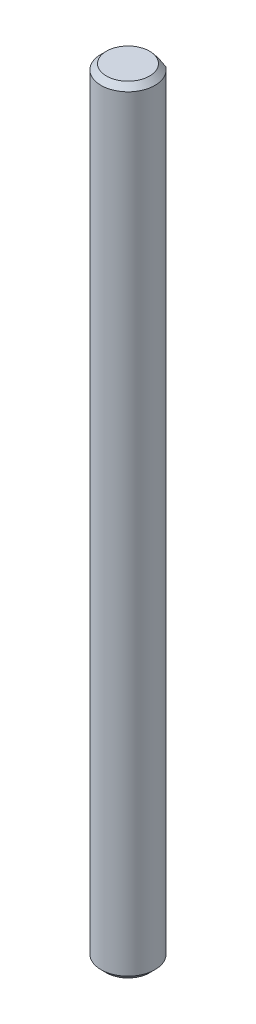
ISO-10303-21;
HEADER;
FILE_DESCRIPTION(('STEP AP214'),'2;1');
FILE_NAME('part.step','',(''),(''),'','','');
FILE_SCHEMA(('AUTOMOTIVE_DESIGN { 1 0 10303 214 1 1 1 1 }'));
ENDSEC;
DATA;
#1=APPLICATION_CONTEXT('core data for automotive mechanical design processes');
#2=APPLICATION_PROTOCOL_DEFINITION('international standard','automotive_design',2000,#1);
#3=PRODUCT_CONTEXT('',#1,'mechanical');
#4=PRODUCT('Part','Part','',(#3));
#5=PRODUCT_RELATED_PRODUCT_CATEGORY('part','',(#4));
#6=PRODUCT_DEFINITION_FORMATION('','',#4);
#7=PRODUCT_DEFINITION_CONTEXT('part definition',#1,'design');
#8=PRODUCT_DEFINITION('design','',#6,#7);
#9=PRODUCT_DEFINITION_SHAPE('','',#8);
#10=(LENGTH_UNIT() NAMED_UNIT(*) SI_UNIT(.MILLI.,.METRE.));
#11=(NAMED_UNIT(*) PLANE_ANGLE_UNIT() SI_UNIT($,.RADIAN.));
#12=(NAMED_UNIT(*) SI_UNIT($,.STERADIAN.) SOLID_ANGLE_UNIT());
#13=UNCERTAINTY_MEASURE_WITH_UNIT(LENGTH_MEASURE(1.E-05),#10,'distance_accuracy_value','');
#14=(GEOMETRIC_REPRESENTATION_CONTEXT(3) GLOBAL_UNCERTAINTY_ASSIGNED_CONTEXT((#13)) GLOBAL_UNIT_ASSIGNED_CONTEXT((#10,
#11,#12)) REPRESENTATION_CONTEXT('',''));
#15=CARTESIAN_POINT('',(0.,0.,0.));
#16=DIRECTION('',(0.,0.,1.));
#17=DIRECTION('',(1.,0.,0.));
#18=AXIS2_PLACEMENT_3D('',#15,#16,#17);
#19=CARTESIAN_POINT('',(0.,72.,0.));
#20=DIRECTION('',(0.,-1.,0.));
#21=DIRECTION('',(0.,0.,-1.));
#22=AXIS2_PLACEMENT_3D('',#19,#20,#21);
#23=CYLINDRICAL_SURFACE('',#22,2.5);
#24=CARTESIAN_POINT('',(0.,0.5,0.));
#25=DIRECTION('',(0.,1.,0.));
#26=DIRECTION('',(0.,0.,1.));
#27=AXIS2_PLACEMENT_3D('',#24,#25,#26);
#28=CIRCLE('',#27,2.5);
#29=CARTESIAN_POINT('',(0.,0.5,2.5));
#30=VERTEX_POINT('',#29);
#31=EDGE_CURVE('E95',#30,#30,#28,.T.);
#32=ORIENTED_EDGE('',*,*,#31,.T.);
#33=EDGE_LOOP('',(#32));
#34=FACE_BOUND('',#33,.T.);
#35=DIRECTION('',(0.,1.,0.));
#36=VECTOR('',#35,1.);
#37=CARTESIAN_POINT('',(1.49999999999995,57.,-1.99999999999995));
#38=LINE('',#37,#36);
#39=CARTESIAN_POINT('',(1.49999999999995,57.,-1.99999999999995));
#40=VERTEX_POINT('',#39);
#41=CARTESIAN_POINT('',(1.49999999999995,71.5,-1.99999999999995));
#42=VERTEX_POINT('',#41);
#43=EDGE_CURVE('E84',#40,#42,#38,.T.);
#44=ORIENTED_EDGE('',*,*,#43,.T.);
#45=CARTESIAN_POINT('',(0.,71.5,0.));
#46=DIRECTION('',(0.,1.,0.));
#47=DIRECTION('',(0.,0.,1.));
#48=AXIS2_PLACEMENT_3D('',#45,#46,#47);
#49=CIRCLE('',#48,2.5);
#50=CARTESIAN_POINT('',(-1.5,71.5,-2.));
#51=VERTEX_POINT('',#50);
#52=EDGE_CURVE('E87',#42,#51,#49,.F.);
#53=ORIENTED_EDGE('',*,*,#52,.T.);
#54=DIRECTION('',(0.,1.,0.));
#55=VECTOR('',#54,1.);
#56=CARTESIAN_POINT('',(-1.5,57.,-2.));
#57=LINE('',#56,#55);
#58=CARTESIAN_POINT('',(-1.5,57.,-2.));
#59=VERTEX_POINT('',#58);
#60=EDGE_CURVE('E82',#59,#51,#57,.T.);
#61=ORIENTED_EDGE('',*,*,#60,.F.);
#62=CARTESIAN_POINT('',(0.,57.,0.));
#63=DIRECTION('',(0.,1.,0.));
#64=DIRECTION('',(0.,0.,1.));
#65=AXIS2_PLACEMENT_3D('',#62,#63,#64);
#66=CIRCLE('',#65,2.5);
#67=EDGE_CURVE('E72',#40,#59,#66,.T.);
#68=ORIENTED_EDGE('',*,*,#67,.F.);
#69=EDGE_LOOP('',(#44,#53,#61,#68));
#70=FACE_BOUND('',#69,.T.);
#71=ADVANCED_FACE('F36',(#34,#70),#23,.T.);
#72=CARTESIAN_POINT('',(0.,72.,0.));
#73=DIRECTION('',(0.,1.,0.));
#74=DIRECTION('',(0.,0.,1.));
#75=AXIS2_PLACEMENT_3D('',#72,#73,#74);
#76=PLANE('',#75);
#77=CARTESIAN_POINT('',(0.,72.,0.));
#78=DIRECTION('',(0.,1.,0.));
#79=DIRECTION('',(0.,0.,1.));
#80=AXIS2_PLACEMENT_3D('',#77,#78,#79);
#81=CIRCLE('',#80,2.);
#82=CARTESIAN_POINT('',(0.,72.,-2.));
#83=VERTEX_POINT('',#82);
#84=EDGE_CURVE('E103',#83,#83,#81,.T.);
#85=ORIENTED_EDGE('',*,*,#84,.T.);
#86=EDGE_LOOP('',(#85));
#87=FACE_BOUND('',#86,.T.);
#88=ADVANCED_FACE('F116',(#87),#76,.T.);
#89=CARTESIAN_POINT('',(0.,0.,0.));
#90=DIRECTION('',(0.,1.,0.));
#91=DIRECTION('',(0.,0.,1.));
#92=AXIS2_PLACEMENT_3D('',#89,#90,#91);
#93=PLANE('',#92);
#94=CARTESIAN_POINT('',(0.,0.,0.));
#95=DIRECTION('',(0.,1.,0.));
#96=DIRECTION('',(0.,0.,1.));
#97=AXIS2_PLACEMENT_3D('',#94,#95,#96);
#98=CIRCLE('',#97,2.00000000000001);
#99=CARTESIAN_POINT('',(0.,0.,2.00000000000001));
#100=VERTEX_POINT('',#99);
#101=EDGE_CURVE('E99',#100,#100,#98,.F.);
#102=ORIENTED_EDGE('',*,*,#101,.T.);
#103=EDGE_LOOP('',(#102));
#104=FACE_BOUND('',#103,.T.);
#105=ADVANCED_FACE('F115',(#104),#93,.F.);
#106=CARTESIAN_POINT('',(-1.5,57.,-2.));
#107=DIRECTION('',(0.,0.,1.));
#108=DIRECTION('',(1.,0.,0.));
#109=AXIS2_PLACEMENT_3D('',#106,#107,#108);
#110=PLANE('',#109);
#111=CARTESIAN_POINT('',(-1.5,71.5,-2.));
#112=CARTESIAN_POINT('',(-1.42763018659214,71.5433736980276,-2.00000000000001));
#113=CARTESIAN_POINT('',(-1.35436226532258,71.5853687019536,-2.));
#114=CARTESIAN_POINT('',(-1.20549660628809,71.6656443583189,-2.));
#115=CARTESIAN_POINT('',(-1.12989157710706,71.7039114197062,-2.));
#116=CARTESIAN_POINT('',(-0.978296734874852,71.774534191742,-2.00000000000001));
#117=CARTESIAN_POINT('',(-0.902366736266433,71.8070165390548,-2.00000000000002));
#118=CARTESIAN_POINT('',(-0.748220644904102,71.8658090166989,-1.99999999999998));
#119=CARTESIAN_POINT('',(-0.670007876047731,71.8921276624893,-1.99999999999993));
#120=CARTESIAN_POINT('',(-0.543060600019271,71.9280861032667,-1.99999999999996));
#121=CARTESIAN_POINT('',(-0.495021163503669,71.9401901027996,-1.99999999999999));
#122=CARTESIAN_POINT('',(-0.398260419217605,71.9612794306282,-2.00000000000001));
#123=CARTESIAN_POINT('',(-0.349539198139873,71.9702651517484,-2.00000000000001));
#124=CARTESIAN_POINT('',(-0.250852177401971,71.9849271240241,-2.));
#125=CARTESIAN_POINT('',(-0.20087865403864,71.9905520018212,-2.));
#126=CARTESIAN_POINT('',(-0.100607619276176,71.9981023484678,-2.));
#127=CARTESIAN_POINT('',(-0.050309847270528,72.0000243314446,-2.00000000000001));
#128=CARTESIAN_POINT('',(0.,72.,-2.));
#129=B_SPLINE_CURVE_WITH_KNOTS('',3,(#111,#112,#113,#114,#115,#116,#117,#118,#119,#120,#121,
#122,#123,#124,#125,#126,#127,#128),.UNSPECIFIED.,.F.,.F.,(4,2,2,2,2,2,2,2,4),(0.,
0.253195034695593,0.507281075974268,0.754837752612848,1.00205037282498,1.15058504578385,
1.29910100031795,1.44983263801685,1.600706103947),.UNSPECIFIED.);
#130=EDGE_CURVE('E51',#51,#83,#129,.T.);
#131=ORIENTED_EDGE('',*,*,#130,.T.);
#132=CARTESIAN_POINT('',(0.,72.,-2.));
#133=CARTESIAN_POINT('',(0.0614966481035625,72.0000514930088,-2.));
#134=CARTESIAN_POINT('',(0.122961796118781,71.997164788165,-2.));
#135=CARTESIAN_POINT('',(0.245274670057061,71.9859212389057,-2.));
#136=CARTESIAN_POINT('',(0.306123362775481,71.9775750221521,-2.));
#137=CARTESIAN_POINT('',(0.425885509906896,71.9559969816614,-2.));
#138=CARTESIAN_POINT('',(0.484814317272316,71.9428488248966,-2.));
#139=CARTESIAN_POINT('',(0.601555526074541,71.9122507618696,-2.));
#140=CARTESIAN_POINT('',(0.659367456410761,71.8947990813251,-2.));
#141=CARTESIAN_POINT('',(0.784576263433318,71.8525702057821,-2.));
#142=CARTESIAN_POINT('',(0.851714510760662,71.8270315815753,-2.));
#143=CARTESIAN_POINT('',(0.984250024576913,71.7717452055525,-2.));
#144=CARTESIAN_POINT('',(1.04964642506795,71.7419954048129,-2.));
#145=CARTESIAN_POINT('',(1.18016546542204,71.6784785026746,-2.));
#146=CARTESIAN_POINT('',(1.24525271545217,71.6446394298057,-2.00000000000001));
#147=CARTESIAN_POINT('',(1.37378197006115,71.5742160914668,-2.));
#148=CARTESIAN_POINT('',(1.43722666174298,71.5376367483736,-1.99999999999998));
#149=CARTESIAN_POINT('',(1.49999999999995,71.5,-1.99999999999995));
#150=B_SPLINE_CURVE_WITH_KNOTS('',3,(#132,#133,#134,#135,#136,#137,#138,#139,#140,#141,#142,
#143,#144,#145,#146,#147,#148,#149),.UNSPECIFIED.,.F.,.F.,(4,2,2,2,2,2,2,2,4),(0.,
0.184371949240827,0.36838605790704,0.549336051664299,0.730360773654899,0.945674044871399,
1.16109243790834,1.38109142427275,1.60070428639636),.UNSPECIFIED.);
#151=EDGE_CURVE('E11',#83,#42,#150,.T.);
#152=ORIENTED_EDGE('',*,*,#151,.T.);
#153=ORIENTED_EDGE('',*,*,#43,.F.);
#154=DIRECTION('',(1.,0.,0.));
#155=VECTOR('',#154,1.);
#156=CARTESIAN_POINT('',(-1.5,57.,-2.));
#157=LINE('',#156,#155);
#158=EDGE_CURVE('E75',#59,#40,#157,.T.);
#159=ORIENTED_EDGE('',*,*,#158,.F.);
#160=ORIENTED_EDGE('',*,*,#60,.T.);
#161=EDGE_LOOP('',(#131,#152,#153,#159,#160));
#162=FACE_BOUND('',#161,.T.);
#163=ADVANCED_FACE('F81',(#162),#110,.F.);
#164=CARTESIAN_POINT('',(0.,57.,0.));
#165=DIRECTION('',(0.,1.,0.));
#166=DIRECTION('',(0.,0.,1.));
#167=AXIS2_PLACEMENT_3D('',#164,#165,#166);
#168=PLANE('',#167);
#169=ORIENTED_EDGE('',*,*,#67,.T.);
#170=ORIENTED_EDGE('',*,*,#158,.T.);
#171=EDGE_LOOP('',(#169,#170));
#172=FACE_BOUND('',#171,.T.);
#173=ADVANCED_FACE('F74',(#172),#168,.T.);
#174=CARTESIAN_POINT('',(0.,0.5,0.));
#175=DIRECTION('',(0.,1.,0.));
#176=DIRECTION('',(0.,0.,1.));
#177=AXIS2_PLACEMENT_3D('',#174,#175,#176);
#178=CONICAL_SURFACE('',#177,2.5,0.785398163397439);
#179=ORIENTED_EDGE('',*,*,#101,.F.);
#180=EDGE_LOOP('',(#179));
#181=FACE_BOUND('',#180,.T.);
#182=ORIENTED_EDGE('',*,*,#31,.F.);
#183=EDGE_LOOP('',(#182));
#184=FACE_BOUND('',#183,.T.);
#185=ADVANCED_FACE('F126',(#181,#184),#178,.T.);
#186=CARTESIAN_POINT('',(0.,72.,0.));
#187=DIRECTION('',(0.,-1.,0.));
#188=DIRECTION('',(0.,0.,-1.));
#189=AXIS2_PLACEMENT_3D('',#186,#187,#188);
#190=CONICAL_SURFACE('',#189,2.,0.785398163397446);
#191=ORIENTED_EDGE('',*,*,#130,.F.);
#192=ORIENTED_EDGE('',*,*,#52,.F.);
#193=ORIENTED_EDGE('',*,*,#151,.F.);
#194=ORIENTED_EDGE('',*,*,#84,.F.);
#195=EDGE_LOOP('',(#191,#192,#193,#194));
#196=FACE_BOUND('',#195,.T.);
#197=ADVANCED_FACE('F38',(#196),#190,.T.);
#198=CLOSED_SHELL('',(#71,#88,#105,#163,#173,#185,#197));
#199=MANIFOLD_SOLID_BREP('B2',#198);
#200=ADVANCED_BREP_SHAPE_REPRESENTATION('',(#18,#199),#14);
#201=SHAPE_DEFINITION_REPRESENTATION(#9,#200);
ENDSEC;
END-ISO-10303-21;
